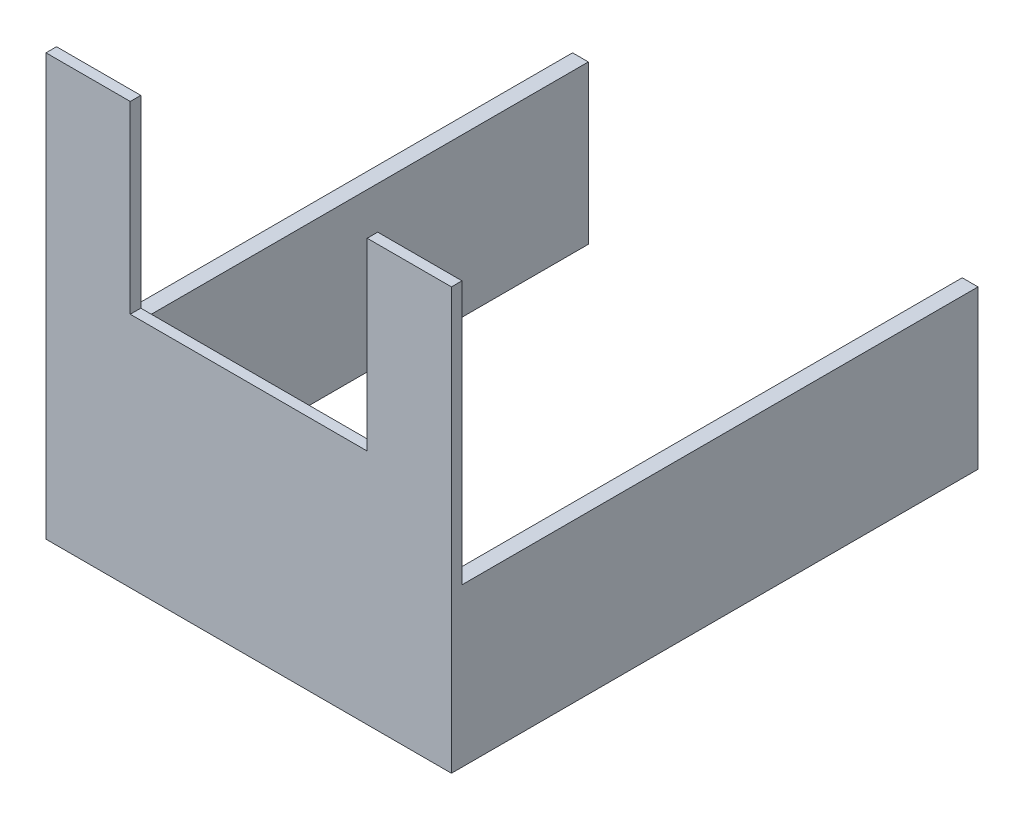
ISO-10303-21;
HEADER;
FILE_DESCRIPTION(('STEP AP214'),'2;1');
FILE_NAME('part.step','',(''),(''),'','','');
FILE_SCHEMA(('AUTOMOTIVE_DESIGN { 1 0 10303 214 1 1 1 1 }'));
ENDSEC;
DATA;
#1=APPLICATION_CONTEXT('core data for automotive mechanical design processes');
#2=APPLICATION_PROTOCOL_DEFINITION('international standard','automotive_design',2000,#1);
#3=PRODUCT_CONTEXT('',#1,'mechanical');
#4=PRODUCT('Part','Part','',(#3));
#5=PRODUCT_RELATED_PRODUCT_CATEGORY('part','',(#4));
#6=PRODUCT_DEFINITION_FORMATION('','',#4);
#7=PRODUCT_DEFINITION_CONTEXT('part definition',#1,'design');
#8=PRODUCT_DEFINITION('design','',#6,#7);
#9=PRODUCT_DEFINITION_SHAPE('','',#8);
#10=(LENGTH_UNIT() NAMED_UNIT(*) SI_UNIT(.MILLI.,.METRE.));
#11=(NAMED_UNIT(*) PLANE_ANGLE_UNIT() SI_UNIT($,.RADIAN.));
#12=(NAMED_UNIT(*) SI_UNIT($,.STERADIAN.) SOLID_ANGLE_UNIT());
#13=UNCERTAINTY_MEASURE_WITH_UNIT(LENGTH_MEASURE(1.E-05),#10,'distance_accuracy_value','');
#14=(GEOMETRIC_REPRESENTATION_CONTEXT(3) GLOBAL_UNCERTAINTY_ASSIGNED_CONTEXT((#13)) GLOBAL_UNIT_ASSIGNED_CONTEXT((#10,
#11,#12)) REPRESENTATION_CONTEXT('',''));
#15=CARTESIAN_POINT('',(0.,0.,0.));
#16=DIRECTION('',(0.,0.,1.));
#17=DIRECTION('',(1.,0.,0.));
#18=AXIS2_PLACEMENT_3D('',#15,#16,#17);
#19=CARTESIAN_POINT('',(0.,0.,0.));
#20=DIRECTION('',(0.,0.,1.));
#21=DIRECTION('',(1.,0.,0.));
#22=AXIS2_PLACEMENT_3D('',#19,#20,#21);
#23=PLANE('',#22);
#24=DIRECTION('',(0.,-1.,0.));
#25=VECTOR('',#24,1.);
#26=CARTESIAN_POINT('',(51.1655172413793,16.7275862068965,0.));
#27=LINE('',#26,#25);
#28=CARTESIAN_POINT('',(51.1655172413793,-33.2724137931034,0.));
#29=VERTEX_POINT('',#28);
#30=CARTESIAN_POINT('',(51.1655172413793,-63.2724137931035,0.));
#31=VERTEX_POINT('',#30);
#32=EDGE_CURVE('E279',#29,#31,#27,.T.);
#33=ORIENTED_EDGE('',*,*,#32,.F.);
#34=DIRECTION('',(-1.,0.,0.));
#35=VECTOR('',#34,1.);
#36=CARTESIAN_POINT('',(75.1655172413793,-33.2724137931034,0.));
#37=LINE('',#36,#35);
#38=CARTESIAN_POINT('',(54.1655172413793,-33.2724137931034,0.));
#39=VERTEX_POINT('',#38);
#40=EDGE_CURVE('E61',#39,#29,#37,.T.);
#41=ORIENTED_EDGE('',*,*,#40,.F.);
#42=DIRECTION('',(0.,1.,0.));
#43=VECTOR('',#42,1.);
#44=CARTESIAN_POINT('',(54.1655172413793,16.7275862068965,0.));
#45=LINE('',#44,#43);
#46=CARTESIAN_POINT('',(54.1655172413793,-63.2724137931035,0.));
#47=VERTEX_POINT('',#46);
#48=EDGE_CURVE('E182',#47,#39,#45,.T.);
#49=ORIENTED_EDGE('',*,*,#48,.F.);
#50=DIRECTION('',(1.,0.,0.));
#51=VECTOR('',#50,1.);
#52=CARTESIAN_POINT('',(-22.8344827586207,-63.2724137931035,0.));
#53=LINE('',#52,#51);
#54=EDGE_CURVE('E169',#31,#47,#53,.T.);
#55=ORIENTED_EDGE('',*,*,#54,.F.);
#56=EDGE_LOOP('',(#33,#41,#49,#55));
#57=FACE_BOUND('',#56,.T.);
#58=ADVANCED_FACE('F45',(#57),#23,.F.);
#59=CARTESIAN_POINT('',(-6.83448275862068,16.7275862068966,0.));
#60=DIRECTION('',(-1.,0.,0.));
#61=DIRECTION('',(0.,-1.,0.));
#62=AXIS2_PLACEMENT_3D('',#59,#60,#61);
#63=PLANE('',#62);
#64=DIRECTION('',(0.,-1.,0.));
#65=VECTOR('',#64,1.);
#66=CARTESIAN_POINT('',(-6.83448275862068,16.7275862068966,98.));
#67=LINE('',#66,#65);
#68=CARTESIAN_POINT('',(-6.83448275862068,16.7275862068965,98.));
#69=VERTEX_POINT('',#68);
#70=CARTESIAN_POINT('',(-6.83448275862068,-18.2724137931035,98.));
#71=VERTEX_POINT('',#70);
#72=EDGE_CURVE('E209',#69,#71,#67,.T.);
#73=ORIENTED_EDGE('',*,*,#72,.F.);
#74=DIRECTION('',(0.,0.,1.));
#75=VECTOR('',#74,1.);
#76=CARTESIAN_POINT('',(-6.83448275862068,16.7275862068966,0.));
#77=LINE('',#76,#75);
#78=CARTESIAN_POINT('',(-6.83448275862068,16.7275862068966,100.));
#79=VERTEX_POINT('',#78);
#80=EDGE_CURVE('E170',#69,#79,#77,.T.);
#81=ORIENTED_EDGE('',*,*,#80,.T.);
#82=DIRECTION('',(0.,-1.,0.));
#83=VECTOR('',#82,1.);
#84=CARTESIAN_POINT('',(-6.83448275862068,16.7275862068966,100.));
#85=LINE('',#84,#83);
#86=CARTESIAN_POINT('',(-6.83448275862068,-18.2724137931035,100.));
#87=VERTEX_POINT('',#86);
#88=EDGE_CURVE('E260',#79,#87,#85,.T.);
#89=ORIENTED_EDGE('',*,*,#88,.T.);
#90=DIRECTION('',(0.,0.,1.));
#91=VECTOR('',#90,1.);
#92=CARTESIAN_POINT('',(-6.83448275862068,-18.2724137931035,0.));
#93=LINE('',#92,#91);
#94=EDGE_CURVE('E227',#71,#87,#93,.T.);
#95=ORIENTED_EDGE('',*,*,#94,.F.);
#96=EDGE_LOOP('',(#73,#81,#89,#95));
#97=FACE_BOUND('',#96,.T.);
#98=ADVANCED_FACE('F313',(#97),#63,.F.);
#99=CARTESIAN_POINT('',(38.1655172413793,16.7275862068966,0.));
#100=DIRECTION('',(1.,0.,0.));
#101=DIRECTION('',(0.,1.,0.));
#102=AXIS2_PLACEMENT_3D('',#99,#100,#101);
#103=PLANE('',#102);
#104=DIRECTION('',(0.,1.,0.));
#105=VECTOR('',#104,1.);
#106=CARTESIAN_POINT('',(38.1655172413793,16.7275862068966,98.));
#107=LINE('',#106,#105);
#108=CARTESIAN_POINT('',(38.1655172413793,-18.2724137931034,98.));
#109=VERTEX_POINT('',#108);
#110=CARTESIAN_POINT('',(38.1655172413793,16.7275862068965,98.));
#111=VERTEX_POINT('',#110);
#112=EDGE_CURVE('E206',#109,#111,#107,.T.);
#113=ORIENTED_EDGE('',*,*,#112,.F.);
#114=DIRECTION('',(0.,0.,1.));
#115=VECTOR('',#114,1.);
#116=CARTESIAN_POINT('',(38.1655172413793,-18.2724137931034,0.));
#117=LINE('',#116,#115);
#118=CARTESIAN_POINT('',(38.1655172413793,-18.2724137931034,100.));
#119=VERTEX_POINT('',#118);
#120=EDGE_CURVE('E217',#109,#119,#117,.T.);
#121=ORIENTED_EDGE('',*,*,#120,.T.);
#122=DIRECTION('',(0.,1.,0.));
#123=VECTOR('',#122,1.);
#124=CARTESIAN_POINT('',(38.1655172413793,16.7275862068966,100.));
#125=LINE('',#124,#123);
#126=CARTESIAN_POINT('',(38.1655172413793,16.7275862068966,100.));
#127=VERTEX_POINT('',#126);
#128=EDGE_CURVE('E232',#119,#127,#125,.T.);
#129=ORIENTED_EDGE('',*,*,#128,.T.);
#130=DIRECTION('',(0.,0.,1.));
#131=VECTOR('',#130,1.);
#132=CARTESIAN_POINT('',(38.1655172413793,16.7275862068966,0.));
#133=LINE('',#132,#131);
#134=EDGE_CURVE('E175',#111,#127,#133,.T.);
#135=ORIENTED_EDGE('',*,*,#134,.F.);
#136=EDGE_LOOP('',(#113,#121,#129,#135));
#137=FACE_BOUND('',#136,.T.);
#138=ADVANCED_FACE('F215',(#137),#103,.F.);
#139=CARTESIAN_POINT('',(-6.83448275862068,-18.2724137931035,0.));
#140=DIRECTION('',(0.,-1.,0.));
#141=DIRECTION('',(1.,0.,0.));
#142=AXIS2_PLACEMENT_3D('',#139,#140,#141);
#143=PLANE('',#142);
#144=DIRECTION('',(1.,0.,0.));
#145=VECTOR('',#144,1.);
#146=CARTESIAN_POINT('',(-6.83448275862068,-18.2724137931035,98.));
#147=LINE('',#146,#145);
#148=EDGE_CURVE('E54',#71,#109,#147,.T.);
#149=ORIENTED_EDGE('',*,*,#148,.F.);
#150=ORIENTED_EDGE('',*,*,#94,.T.);
#151=DIRECTION('',(1.,0.,0.));
#152=VECTOR('',#151,1.);
#153=CARTESIAN_POINT('',(-6.83448275862068,-18.2724137931035,100.));
#154=LINE('',#153,#152);
#155=EDGE_CURVE('E224',#87,#119,#154,.T.);
#156=ORIENTED_EDGE('',*,*,#155,.T.);
#157=ORIENTED_EDGE('',*,*,#120,.F.);
#158=EDGE_LOOP('',(#149,#150,#156,#157));
#159=FACE_BOUND('',#158,.T.);
#160=ADVANCED_FACE('F222',(#159),#143,.F.);
#161=CARTESIAN_POINT('',(-22.8344827586207,16.7275862068965,100.));
#162=DIRECTION('',(0.,-1.,0.));
#163=DIRECTION('',(0.,0.,-1.));
#164=AXIS2_PLACEMENT_3D('',#161,#162,#163);
#165=PLANE('',#164);
#166=DIRECTION('',(1.,0.,0.));
#167=VECTOR('',#166,1.);
#168=CARTESIAN_POINT('',(51.1655172413793,16.7275862068965,98.));
#169=LINE('',#168,#167);
#170=CARTESIAN_POINT('',(-22.8344827586207,16.7275862068965,98.));
#171=VERTEX_POINT('',#170);
#172=EDGE_CURVE('E272',#171,#69,#169,.T.);
#173=ORIENTED_EDGE('',*,*,#172,.F.);
#174=DIRECTION('',(0.,0.,-1.));
#175=VECTOR('',#174,1.);
#176=CARTESIAN_POINT('',(-22.8344827586207,16.7275862068965,100.));
#177=LINE('',#176,#175);
#178=CARTESIAN_POINT('',(-22.8344827586207,16.7275862068965,100.));
#179=VERTEX_POINT('',#178);
#180=EDGE_CURVE('E187',#179,#171,#177,.T.);
#181=ORIENTED_EDGE('',*,*,#180,.F.);
#182=DIRECTION('',(-1.,0.,0.));
#183=VECTOR('',#182,1.);
#184=CARTESIAN_POINT('',(-22.8344827586207,16.7275862068965,100.));
#185=LINE('',#184,#183);
#186=EDGE_CURVE('E242',#79,#179,#185,.T.);
#187=ORIENTED_EDGE('',*,*,#186,.F.);
#188=ORIENTED_EDGE('',*,*,#80,.F.);
#189=EDGE_LOOP('',(#173,#181,#187,#188));
#190=FACE_BOUND('',#189,.T.);
#191=ADVANCED_FACE('F310',(#190),#165,.F.);
#192=CARTESIAN_POINT('',(-22.8344827586207,16.7275862068965,100.));
#193=DIRECTION('',(1.,0.,0.));
#194=DIRECTION('',(0.,1.,0.));
#195=AXIS2_PLACEMENT_3D('',#192,#193,#194);
#196=PLANE('',#195);
#197=ORIENTED_EDGE('',*,*,#180,.T.);
#198=DIRECTION('',(0.,1.,0.));
#199=VECTOR('',#198,1.);
#200=CARTESIAN_POINT('',(-22.8344827586207,16.7275862068965,98.));
#201=LINE('',#200,#199);
#202=CARTESIAN_POINT('',(-22.8344827586207,-33.2724137931035,98.));
#203=VERTEX_POINT('',#202);
#204=EDGE_CURVE('E154',#203,#171,#201,.T.);
#205=ORIENTED_EDGE('',*,*,#204,.F.);
#206=DIRECTION('',(0.,0.,1.));
#207=VECTOR('',#206,1.);
#208=CARTESIAN_POINT('',(-22.8344827586207,-33.2724137931035,0.));
#209=LINE('',#208,#207);
#210=CARTESIAN_POINT('',(-22.8344827586207,-33.2724137931035,0.));
#211=VERTEX_POINT('',#210);
#212=EDGE_CURVE('E147',#211,#203,#209,.T.);
#213=ORIENTED_EDGE('',*,*,#212,.F.);
#214=DIRECTION('',(0.,-1.,0.));
#215=VECTOR('',#214,1.);
#216=CARTESIAN_POINT('',(-22.8344827586207,16.7275862068965,0.));
#217=LINE('',#216,#215);
#218=CARTESIAN_POINT('',(-22.8344827586207,-63.2724137931035,0.));
#219=VERTEX_POINT('',#218);
#220=EDGE_CURVE('E159',#211,#219,#217,.T.);
#221=ORIENTED_EDGE('',*,*,#220,.T.);
#222=DIRECTION('',(0.,0.,-1.));
#223=VECTOR('',#222,1.);
#224=CARTESIAN_POINT('',(-22.8344827586207,-63.2724137931035,100.));
#225=LINE('',#224,#223);
#226=CARTESIAN_POINT('',(-22.8344827586207,-63.2724137931035,100.));
#227=VERTEX_POINT('',#226);
#228=EDGE_CURVE('E198',#227,#219,#225,.T.);
#229=ORIENTED_EDGE('',*,*,#228,.F.);
#230=DIRECTION('',(0.,-1.,0.));
#231=VECTOR('',#230,1.);
#232=CARTESIAN_POINT('',(-22.8344827586207,16.7275862068965,100.));
#233=LINE('',#232,#231);
#234=EDGE_CURVE('E186',#179,#227,#233,.T.);
#235=ORIENTED_EDGE('',*,*,#234,.F.);
#236=EDGE_LOOP('',(#197,#205,#213,#221,#229,#235));
#237=FACE_BOUND('',#236,.T.);
#238=ADVANCED_FACE('F47',(#237),#196,.F.);
#239=CARTESIAN_POINT('',(-22.8344827586207,-63.2724137931035,100.));
#240=DIRECTION('',(0.,1.,0.));
#241=DIRECTION('',(0.,0.,1.));
#242=AXIS2_PLACEMENT_3D('',#239,#240,#241);
#243=PLANE('',#242);
#244=DIRECTION('',(-1.,0.,0.));
#245=VECTOR('',#244,1.);
#246=CARTESIAN_POINT('',(51.1655172413793,-63.2724137931035,98.));
#247=LINE('',#246,#245);
#248=CARTESIAN_POINT('',(51.1655172413793,-63.2724137931035,98.));
#249=VERTEX_POINT('',#248);
#250=CARTESIAN_POINT('',(-19.8344827586207,-63.2724137931035,98.));
#251=VERTEX_POINT('',#250);
#252=EDGE_CURVE('E288',#249,#251,#247,.T.);
#253=ORIENTED_EDGE('',*,*,#252,.F.);
#254=DIRECTION('',(0.,0.,-1.));
#255=VECTOR('',#254,1.);
#256=CARTESIAN_POINT('',(51.1655172413793,-63.2724137931035,98.));
#257=LINE('',#256,#255);
#258=EDGE_CURVE('E268',#249,#31,#257,.T.);
#259=ORIENTED_EDGE('',*,*,#258,.T.);
#260=ORIENTED_EDGE('',*,*,#54,.T.);
#261=DIRECTION('',(0.,0.,-1.));
#262=VECTOR('',#261,1.);
#263=CARTESIAN_POINT('',(54.1655172413793,-63.2724137931035,100.));
#264=LINE('',#263,#262);
#265=CARTESIAN_POINT('',(54.1655172413793,-63.2724137931035,100.));
#266=VERTEX_POINT('',#265);
#267=EDGE_CURVE('E194',#266,#47,#264,.T.);
#268=ORIENTED_EDGE('',*,*,#267,.F.);
#269=DIRECTION('',(1.,0.,0.));
#270=VECTOR('',#269,1.);
#271=CARTESIAN_POINT('',(-22.8344827586207,-63.2724137931035,100.));
#272=LINE('',#271,#270);
#273=EDGE_CURVE('E238',#227,#266,#272,.T.);
#274=ORIENTED_EDGE('',*,*,#273,.F.);
#275=ORIENTED_EDGE('',*,*,#228,.T.);
#276=CARTESIAN_POINT('',(-19.8344827586207,-63.2724137931035,0.));
#277=VERTEX_POINT('',#276);
#278=EDGE_CURVE('E166',#219,#277,#53,.T.);
#279=ORIENTED_EDGE('',*,*,#278,.T.);
#280=DIRECTION('',(0.,0.,-1.));
#281=VECTOR('',#280,1.);
#282=CARTESIAN_POINT('',(-19.8344827586207,-63.2724137931035,98.));
#283=LINE('',#282,#281);
#284=EDGE_CURVE('E220',#251,#277,#283,.T.);
#285=ORIENTED_EDGE('',*,*,#284,.F.);
#286=EDGE_LOOP('',(#253,#259,#260,#268,#274,#275,#279,#285));
#287=FACE_BOUND('',#286,.T.);
#288=ADVANCED_FACE('F332',(#287),#243,.F.);
#289=CARTESIAN_POINT('',(54.1655172413793,16.7275862068965,100.));
#290=DIRECTION('',(-1.,0.,0.));
#291=DIRECTION('',(0.,0.,1.));
#292=AXIS2_PLACEMENT_3D('',#289,#290,#291);
#293=PLANE('',#292);
#294=DIRECTION('',(0.,0.,1.));
#295=VECTOR('',#294,1.);
#296=CARTESIAN_POINT('',(54.1655172413793,-33.2724137931034,100.));
#297=LINE('',#296,#295);
#298=CARTESIAN_POINT('',(54.1655172413793,-33.2724137931034,98.));
#299=VERTEX_POINT('',#298);
#300=EDGE_CURVE('E297',#39,#299,#297,.T.);
#301=ORIENTED_EDGE('',*,*,#300,.T.);
#302=DIRECTION('',(0.,1.,0.));
#303=VECTOR('',#302,1.);
#304=CARTESIAN_POINT('',(54.1655172413793,16.7275862068965,98.));
#305=LINE('',#304,#303);
#306=CARTESIAN_POINT('',(54.1655172413793,16.7275862068966,98.));
#307=VERTEX_POINT('',#306);
#308=EDGE_CURVE('E282',#299,#307,#305,.T.);
#309=ORIENTED_EDGE('',*,*,#308,.T.);
#310=DIRECTION('',(0.,0.,-1.));
#311=VECTOR('',#310,1.);
#312=CARTESIAN_POINT('',(54.1655172413793,16.7275862068965,100.));
#313=LINE('',#312,#311);
#314=CARTESIAN_POINT('',(54.1655172413793,16.7275862068965,100.));
#315=VERTEX_POINT('',#314);
#316=EDGE_CURVE('E190',#315,#307,#313,.T.);
#317=ORIENTED_EDGE('',*,*,#316,.F.);
#318=DIRECTION('',(0.,1.,0.));
#319=VECTOR('',#318,1.);
#320=CARTESIAN_POINT('',(54.1655172413793,16.7275862068965,100.));
#321=LINE('',#320,#319);
#322=EDGE_CURVE('E240',#266,#315,#321,.T.);
#323=ORIENTED_EDGE('',*,*,#322,.F.);
#324=ORIENTED_EDGE('',*,*,#267,.T.);
#325=ORIENTED_EDGE('',*,*,#48,.T.);
#326=EDGE_LOOP('',(#301,#309,#317,#323,#324,#325));
#327=FACE_BOUND('',#326,.T.);
#328=ADVANCED_FACE('F330',(#327),#293,.F.);
#329=ORIENTED_EDGE('',*,*,#316,.T.);
#330=EDGE_CURVE('E256',#111,#307,#169,.T.);
#331=ORIENTED_EDGE('',*,*,#330,.F.);
#332=ORIENTED_EDGE('',*,*,#134,.T.);
#333=EDGE_CURVE('E178',#315,#127,#185,.T.);
#334=ORIENTED_EDGE('',*,*,#333,.F.);
#335=EDGE_LOOP('',(#329,#331,#332,#334));
#336=FACE_BOUND('',#335,.T.);
#337=ADVANCED_FACE('F255',(#336),#165,.F.);
#338=CARTESIAN_POINT('',(0.,0.,100.));
#339=DIRECTION('',(0.,0.,1.));
#340=DIRECTION('',(1.,0.,0.));
#341=AXIS2_PLACEMENT_3D('',#338,#339,#340);
#342=PLANE('',#341);
#343=ORIENTED_EDGE('',*,*,#88,.F.);
#344=ORIENTED_EDGE('',*,*,#186,.T.);
#345=ORIENTED_EDGE('',*,*,#234,.T.);
#346=ORIENTED_EDGE('',*,*,#273,.T.);
#347=ORIENTED_EDGE('',*,*,#322,.T.);
#348=ORIENTED_EDGE('',*,*,#333,.T.);
#349=ORIENTED_EDGE('',*,*,#128,.F.);
#350=ORIENTED_EDGE('',*,*,#155,.F.);
#351=EDGE_LOOP('',(#343,#344,#345,#346,#347,#348,#349,#350));
#352=FACE_BOUND('',#351,.T.);
#353=ADVANCED_FACE('F253',(#352),#342,.T.);
#354=ORIENTED_EDGE('',*,*,#220,.F.);
#355=CARTESIAN_POINT('',(-19.8344827586207,-33.2724137931035,0.));
#356=VERTEX_POINT('',#355);
#357=EDGE_CURVE('E144',#356,#211,#37,.T.);
#358=ORIENTED_EDGE('',*,*,#357,.F.);
#359=DIRECTION('',(0.,1.,0.));
#360=VECTOR('',#359,1.);
#361=CARTESIAN_POINT('',(-19.8344827586207,16.7275862068965,0.));
#362=LINE('',#361,#360);
#363=EDGE_CURVE('E275',#277,#356,#362,.T.);
#364=ORIENTED_EDGE('',*,*,#363,.F.);
#365=ORIENTED_EDGE('',*,*,#278,.F.);
#366=EDGE_LOOP('',(#354,#358,#364,#365));
#367=FACE_BOUND('',#366,.T.);
#368=ADVANCED_FACE('F164',(#367),#23,.F.);
#369=CARTESIAN_POINT('',(0.,0.,98.));
#370=DIRECTION('',(0.,0.,-1.));
#371=DIRECTION('',(-1.,0.,0.));
#372=AXIS2_PLACEMENT_3D('',#369,#370,#371);
#373=PLANE('',#372);
#374=DIRECTION('',(0.,1.,0.));
#375=VECTOR('',#374,1.);
#376=CARTESIAN_POINT('',(-19.8344827586207,16.7275862068965,98.));
#377=LINE('',#376,#375);
#378=CARTESIAN_POINT('',(-19.8344827586207,-33.2724137931035,98.));
#379=VERTEX_POINT('',#378);
#380=EDGE_CURVE('E285',#251,#379,#377,.T.);
#381=ORIENTED_EDGE('',*,*,#380,.T.);
#382=DIRECTION('',(-1.,0.,0.));
#383=VECTOR('',#382,1.);
#384=CARTESIAN_POINT('',(75.1655172413793,-33.2724137931034,98.));
#385=LINE('',#384,#383);
#386=EDGE_CURVE('E69',#379,#203,#385,.T.);
#387=ORIENTED_EDGE('',*,*,#386,.T.);
#388=ORIENTED_EDGE('',*,*,#204,.T.);
#389=ORIENTED_EDGE('',*,*,#172,.T.);
#390=ORIENTED_EDGE('',*,*,#72,.T.);
#391=ORIENTED_EDGE('',*,*,#148,.T.);
#392=ORIENTED_EDGE('',*,*,#112,.T.);
#393=ORIENTED_EDGE('',*,*,#330,.T.);
#394=ORIENTED_EDGE('',*,*,#308,.F.);
#395=CARTESIAN_POINT('',(51.1655172413793,-33.2724137931034,98.));
#396=VERTEX_POINT('',#395);
#397=EDGE_CURVE('E303',#299,#396,#385,.T.);
#398=ORIENTED_EDGE('',*,*,#397,.T.);
#399=DIRECTION('',(0.,-1.,0.));
#400=VECTOR('',#399,1.);
#401=CARTESIAN_POINT('',(51.1655172413793,16.7275862068965,98.));
#402=LINE('',#401,#400);
#403=EDGE_CURVE('E278',#396,#249,#402,.T.);
#404=ORIENTED_EDGE('',*,*,#403,.T.);
#405=ORIENTED_EDGE('',*,*,#252,.T.);
#406=EDGE_LOOP('',(#381,#387,#388,#389,#390,#391,#392,#393,#394,#398,#404,#405));
#407=FACE_BOUND('',#406,.T.);
#408=ADVANCED_FACE('F205',(#407),#373,.T.);
#409=CARTESIAN_POINT('',(51.1655172413793,16.7275862068965,98.));
#410=DIRECTION('',(1.,0.,0.));
#411=DIRECTION('',(0.,1.,0.));
#412=AXIS2_PLACEMENT_3D('',#409,#410,#411);
#413=PLANE('',#412);
#414=ORIENTED_EDGE('',*,*,#403,.F.);
#415=DIRECTION('',(0.,0.,-1.));
#416=VECTOR('',#415,1.);
#417=CARTESIAN_POINT('',(51.1655172413793,-33.2724137931034,98.));
#418=LINE('',#417,#416);
#419=EDGE_CURVE('E301',#396,#29,#418,.T.);
#420=ORIENTED_EDGE('',*,*,#419,.T.);
#421=ORIENTED_EDGE('',*,*,#32,.T.);
#422=ORIENTED_EDGE('',*,*,#258,.F.);
#423=EDGE_LOOP('',(#414,#420,#421,#422));
#424=FACE_BOUND('',#423,.T.);
#425=ADVANCED_FACE('F348',(#424),#413,.F.);
#426=CARTESIAN_POINT('',(-19.8344827586207,16.7275862068965,98.));
#427=DIRECTION('',(-1.,0.,0.));
#428=DIRECTION('',(0.,-1.,0.));
#429=AXIS2_PLACEMENT_3D('',#426,#427,#428);
#430=PLANE('',#429);
#431=ORIENTED_EDGE('',*,*,#363,.T.);
#432=DIRECTION('',(0.,0.,1.));
#433=VECTOR('',#432,1.);
#434=CARTESIAN_POINT('',(-19.8344827586207,-33.2724137931035,98.));
#435=LINE('',#434,#433);
#436=EDGE_CURVE('E11',#356,#379,#435,.T.);
#437=ORIENTED_EDGE('',*,*,#436,.T.);
#438=ORIENTED_EDGE('',*,*,#380,.F.);
#439=ORIENTED_EDGE('',*,*,#284,.T.);
#440=EDGE_LOOP('',(#431,#437,#438,#439));
#441=FACE_BOUND('',#440,.T.);
#442=ADVANCED_FACE('F361',(#441),#430,.F.);
#443=CARTESIAN_POINT('',(75.1655172413793,-33.2724137931034,0.));
#444=DIRECTION('',(0.,-1.,0.));
#445=DIRECTION('',(1.,0.,0.));
#446=AXIS2_PLACEMENT_3D('',#443,#444,#445);
#447=PLANE('',#446);
#448=ORIENTED_EDGE('',*,*,#357,.T.);
#449=ORIENTED_EDGE('',*,*,#212,.T.);
#450=ORIENTED_EDGE('',*,*,#386,.F.);
#451=ORIENTED_EDGE('',*,*,#436,.F.);
#452=EDGE_LOOP('',(#448,#449,#450,#451));
#453=FACE_BOUND('',#452,.T.);
#454=ADVANCED_FACE('F146',(#453),#447,.F.);
#455=ORIENTED_EDGE('',*,*,#40,.T.);
#456=ORIENTED_EDGE('',*,*,#419,.F.);
#457=ORIENTED_EDGE('',*,*,#397,.F.);
#458=ORIENTED_EDGE('',*,*,#300,.F.);
#459=EDGE_LOOP('',(#455,#456,#457,#458));
#460=FACE_BOUND('',#459,.T.);
#461=ADVANCED_FACE('F352',(#460),#447,.F.);
#462=CLOSED_SHELL('',(#58,#98,#138,#160,#191,#238,#288,#328,#337,#353,#368,#408,#425,#442,#454,#461));
#463=MANIFOLD_SOLID_BREP('B2',#462);
#464=ADVANCED_BREP_SHAPE_REPRESENTATION('',(#18,#463),#14);
#465=SHAPE_DEFINITION_REPRESENTATION(#9,#464);
ENDSEC;
END-ISO-10303-21;
